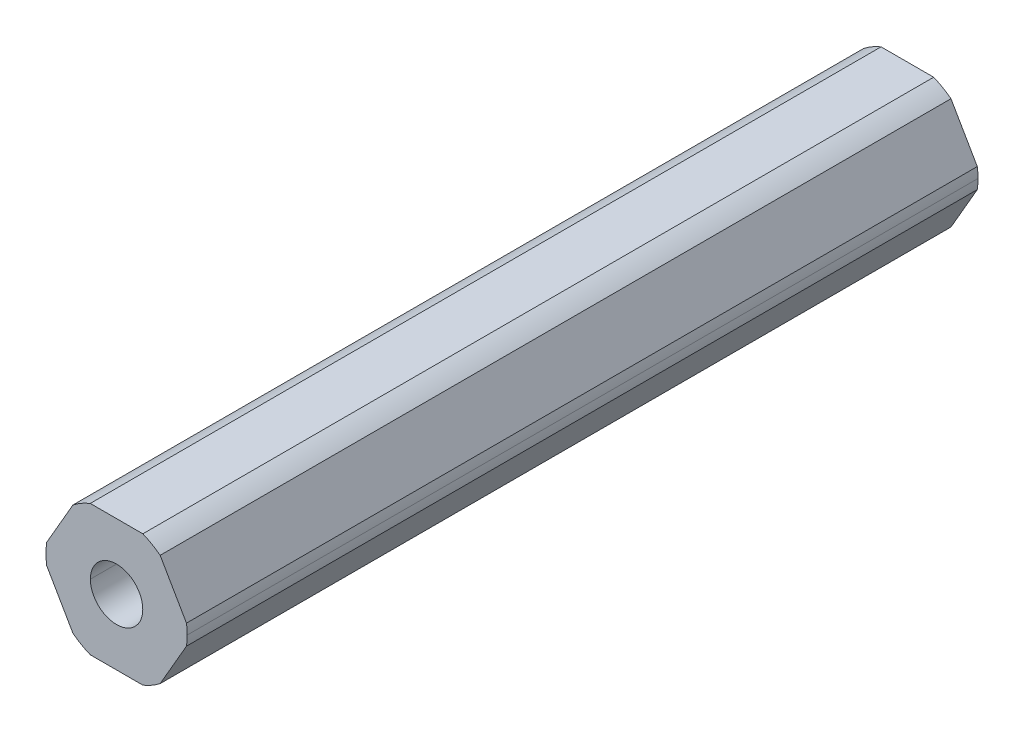
ISO-10303-21;
HEADER;
FILE_DESCRIPTION(('STEP AP214'),'2;1');
FILE_NAME('part.step','',(''),(''),'','','');
FILE_SCHEMA(('AUTOMOTIVE_DESIGN { 1 0 10303 214 1 1 1 1 }'));
ENDSEC;
DATA;
#1=APPLICATION_CONTEXT('core data for automotive mechanical design processes');
#2=APPLICATION_PROTOCOL_DEFINITION('international standard','automotive_design',2000,#1);
#3=PRODUCT_CONTEXT('',#1,'mechanical');
#4=PRODUCT('Part','Part','',(#3));
#5=PRODUCT_RELATED_PRODUCT_CATEGORY('part','',(#4));
#6=PRODUCT_DEFINITION_FORMATION('','',#4);
#7=PRODUCT_DEFINITION_CONTEXT('part definition',#1,'design');
#8=PRODUCT_DEFINITION('design','',#6,#7);
#9=PRODUCT_DEFINITION_SHAPE('','',#8);
#10=(LENGTH_UNIT() NAMED_UNIT(*) SI_UNIT(.MILLI.,.METRE.));
#11=(NAMED_UNIT(*) PLANE_ANGLE_UNIT() SI_UNIT($,.RADIAN.));
#12=(NAMED_UNIT(*) SI_UNIT($,.STERADIAN.) SOLID_ANGLE_UNIT());
#13=UNCERTAINTY_MEASURE_WITH_UNIT(LENGTH_MEASURE(1.E-05),#10,'distance_accuracy_value','');
#14=(GEOMETRIC_REPRESENTATION_CONTEXT(3) GLOBAL_UNCERTAINTY_ASSIGNED_CONTEXT((#13)) GLOBAL_UNIT_ASSIGNED_CONTEXT((#10,
#11,#12)) REPRESENTATION_CONTEXT('',''));
#15=CARTESIAN_POINT('',(0.,0.,0.));
#16=DIRECTION('',(0.,0.,1.));
#17=DIRECTION('',(1.,0.,0.));
#18=AXIS2_PLACEMENT_3D('',#15,#16,#17);
#19=CARTESIAN_POINT('',(0.,0.,-228.6));
#20=DIRECTION('',(0.,0.,1.));
#21=DIRECTION('',(1.,0.,0.));
#22=AXIS2_PLACEMENT_3D('',#19,#20,#21);
#23=CYLINDRICAL_SURFACE('',#22,2.55);
#24=DIRECTION('',(0.,0.,1.));
#25=VECTOR('',#24,1.);
#26=CARTESIAN_POINT('',(2.55,0.,-228.6));
#27=LINE('',#26,#25);
#28=CARTESIAN_POINT('',(2.55,0.,-220.97475));
#29=VERTEX_POINT('',#28);
#30=CARTESIAN_POINT('',(2.55,0.,-144.04975));
#31=VERTEX_POINT('',#30);
#32=EDGE_CURVE('E156',#29,#31,#27,.T.);
#33=ORIENTED_EDGE('',*,*,#32,.F.);
#34=CARTESIAN_POINT('',(0.,0.,-220.97475));
#35=DIRECTION('',(0.,0.,1.));
#36=DIRECTION('',(1.,0.,0.));
#37=AXIS2_PLACEMENT_3D('',#34,#35,#36);
#38=CIRCLE('',#37,2.55);
#39=CARTESIAN_POINT('',(-2.55,0.,-220.97475));
#40=VERTEX_POINT('',#39);
#41=EDGE_CURVE('E67',#29,#40,#38,.F.);
#42=ORIENTED_EDGE('',*,*,#41,.T.);
#43=DIRECTION('',(0.,0.,1.));
#44=VECTOR('',#43,1.);
#45=CARTESIAN_POINT('',(-2.55,0.,-228.6));
#46=LINE('',#45,#44);
#47=CARTESIAN_POINT('',(-2.55,0.,-144.04975));
#48=VERTEX_POINT('',#47);
#49=EDGE_CURVE('E154',#40,#48,#46,.T.);
#50=ORIENTED_EDGE('',*,*,#49,.T.);
#51=CARTESIAN_POINT('',(0.,0.,-144.04975));
#52=DIRECTION('',(0.,0.,1.));
#53=DIRECTION('',(1.,0.,0.));
#54=AXIS2_PLACEMENT_3D('',#51,#52,#53);
#55=CIRCLE('',#54,2.55);
#56=EDGE_CURVE('E203',#31,#48,#55,.F.);
#57=ORIENTED_EDGE('',*,*,#56,.F.);
#58=EDGE_LOOP('',(#33,#42,#50,#57));
#59=FACE_BOUND('',#58,.T.);
#60=ADVANCED_FACE('F44',(#59),#23,.F.);
#61=CARTESIAN_POINT('',(0.,0.,-228.6));
#62=DIRECTION('',(0.,0.,1.));
#63=DIRECTION('',(1.,0.,0.));
#64=AXIS2_PLACEMENT_3D('',#61,#62,#63);
#65=CYLINDRICAL_SURFACE('',#64,6.87);
#66=CARTESIAN_POINT('',(0.,0.,-220.97475));
#67=DIRECTION('',(0.,0.,1.));
#68=DIRECTION('',(1.,0.,0.));
#69=AXIS2_PLACEMENT_3D('',#66,#67,#68);
#70=CIRCLE('',#69,6.87);
#71=CARTESIAN_POINT('',(6.87,0.,-220.97475));
#72=VERTEX_POINT('',#71);
#73=CARTESIAN_POINT('',(6.80102150534208,-0.971085209378955,-220.97475));
#74=VERTEX_POINT('',#73);
#75=EDGE_CURVE('E322',#72,#74,#70,.F.);
#76=ORIENTED_EDGE('',*,*,#75,.F.);
#77=DIRECTION('',(0.,0.,1.));
#78=VECTOR('',#77,1.);
#79=CARTESIAN_POINT('',(6.87,0.,-228.6));
#80=LINE('',#79,#78);
#81=CARTESIAN_POINT('',(6.87,0.,-144.04975));
#82=VERTEX_POINT('',#81);
#83=EDGE_CURVE('E164',#72,#82,#80,.T.);
#84=ORIENTED_EDGE('',*,*,#83,.T.);
#85=CARTESIAN_POINT('',(0.,0.,-144.04975));
#86=DIRECTION('',(0.,0.,1.));
#87=DIRECTION('',(1.,0.,0.));
#88=AXIS2_PLACEMENT_3D('',#85,#86,#87);
#89=CIRCLE('',#88,6.87);
#90=CARTESIAN_POINT('',(6.80102150534208,-0.971085209378955,-144.04975));
#91=VERTEX_POINT('',#90);
#92=EDGE_CURVE('E324',#91,#82,#89,.T.);
#93=ORIENTED_EDGE('',*,*,#92,.F.);
#94=DIRECTION('',(0.,0.,-1.));
#95=VECTOR('',#94,1.);
#96=CARTESIAN_POINT('',(6.80102150534208,-0.971085209378962,-228.6));
#97=LINE('',#96,#95);
#98=EDGE_CURVE('E170',#91,#74,#97,.T.);
#99=ORIENTED_EDGE('',*,*,#98,.T.);
#100=EDGE_LOOP('',(#76,#84,#93,#99));
#101=FACE_BOUND('',#100,.T.);
#102=ADVANCED_FACE('F321',(#101),#65,.T.);
#103=CARTESIAN_POINT('',(3.68083890619154,-6.3754,228.6));
#104=DIRECTION('',(-0.866025403784439,0.5,0.));
#105=DIRECTION('',(0.,0.,1.));
#106=AXIS2_PLACEMENT_3D('',#103,#104,#105);
#107=PLANE('',#106);
#108=DIRECTION('',(0.,0.,1.));
#109=VECTOR('',#108,1.);
#110=CARTESIAN_POINT('',(4.24149521323255,-5.40431479062104,-228.6));
#111=LINE('',#110,#109);
#112=CARTESIAN_POINT('',(4.24149521323254,-5.40431479062105,-220.97475));
#113=VERTEX_POINT('',#112);
#114=CARTESIAN_POINT('',(4.24149521323254,-5.40431479062105,-144.04975));
#115=VERTEX_POINT('',#114);
#116=EDGE_CURVE('E181',#113,#115,#111,.T.);
#117=ORIENTED_EDGE('',*,*,#116,.F.);
#118=DIRECTION('',(0.5,0.866025403784439,0.));
#119=VECTOR('',#118,1.);
#120=CARTESIAN_POINT('',(3.68083890619154,-6.3754,-220.97475));
#121=LINE('',#120,#119);
#122=EDGE_CURVE('E318',#113,#74,#121,.T.);
#123=ORIENTED_EDGE('',*,*,#122,.T.);
#124=ORIENTED_EDGE('',*,*,#98,.F.);
#125=DIRECTION('',(0.500000000000001,0.866025403784438,0.));
#126=VECTOR('',#125,1.);
#127=CARTESIAN_POINT('',(4.24149521323254,-5.40431479062105,-144.04975));
#128=LINE('',#127,#126);
#129=EDGE_CURVE('E265',#115,#91,#128,.T.);
#130=ORIENTED_EDGE('',*,*,#129,.F.);
#131=EDGE_LOOP('',(#117,#123,#124,#130));
#132=FACE_BOUND('',#131,.T.);
#133=ADVANCED_FACE('F316',(#132),#107,.F.);
#134=CARTESIAN_POINT('',(7.36167781238308,0.,228.6));
#135=DIRECTION('',(-0.866025403784439,-0.5,0.));
#136=DIRECTION('',(-0.5,0.866025403784439,0.));
#137=AXIS2_PLACEMENT_3D('',#134,#135,#136);
#138=PLANE('',#137);
#139=DIRECTION('',(0.,0.,1.));
#140=VECTOR('',#139,1.);
#141=CARTESIAN_POINT('',(6.80102150534208,0.971085209378949,-228.6));
#142=LINE('',#141,#140);
#143=CARTESIAN_POINT('',(6.80102150534208,0.97108520937895,-220.97475));
#144=VERTEX_POINT('',#143);
#145=CARTESIAN_POINT('',(6.80102150534208,0.97108520937895,-144.04975));
#146=VERTEX_POINT('',#145);
#147=EDGE_CURVE('E174',#144,#146,#142,.T.);
#148=ORIENTED_EDGE('',*,*,#147,.F.);
#149=DIRECTION('',(-0.5,0.866025403784439,0.));
#150=VECTOR('',#149,1.);
#151=CARTESIAN_POINT('',(7.36167781238308,0.,-220.97475));
#152=LINE('',#151,#150);
#153=CARTESIAN_POINT('',(4.24149521323254,5.40431479062105,-220.97475));
#154=VERTEX_POINT('',#153);
#155=EDGE_CURVE('E351',#144,#154,#152,.T.);
#156=ORIENTED_EDGE('',*,*,#155,.T.);
#157=DIRECTION('',(0.,0.,-1.));
#158=VECTOR('',#157,1.);
#159=CARTESIAN_POINT('',(4.24149521323254,5.40431479062105,-228.6));
#160=LINE('',#159,#158);
#161=CARTESIAN_POINT('',(4.24149521323254,5.40431479062105,-144.04975));
#162=VERTEX_POINT('',#161);
#163=EDGE_CURVE('E204',#162,#154,#160,.T.);
#164=ORIENTED_EDGE('',*,*,#163,.F.);
#165=DIRECTION('',(-0.5,0.866025403784438,0.));
#166=VECTOR('',#165,1.);
#167=CARTESIAN_POINT('',(6.80102150534208,0.97108520937895,-144.04975));
#168=LINE('',#167,#166);
#169=EDGE_CURVE('E232',#146,#162,#168,.T.);
#170=ORIENTED_EDGE('',*,*,#169,.F.);
#171=EDGE_LOOP('',(#148,#156,#164,#170));
#172=FACE_BOUND('',#171,.T.);
#173=ADVANCED_FACE('F360',(#172),#138,.F.);
#174=CARTESIAN_POINT('',(3.68083890619154,6.3754,228.6));
#175=DIRECTION('',(0.,-1.,0.));
#176=DIRECTION('',(0.,0.,-1.));
#177=AXIS2_PLACEMENT_3D('',#174,#175,#176);
#178=PLANE('',#177);
#179=DIRECTION('',(0.,0.,1.));
#180=VECTOR('',#179,1.);
#181=CARTESIAN_POINT('',(2.55952629210952,6.3754,-228.6));
#182=LINE('',#181,#180);
#183=CARTESIAN_POINT('',(2.55952629210952,6.3754,-220.97475));
#184=VERTEX_POINT('',#183);
#185=CARTESIAN_POINT('',(2.55952629210953,6.3754,-144.04975));
#186=VERTEX_POINT('',#185);
#187=EDGE_CURVE('E202',#184,#186,#182,.T.);
#188=ORIENTED_EDGE('',*,*,#187,.F.);
#189=DIRECTION('',(-1.,0.,0.));
#190=VECTOR('',#189,1.);
#191=CARTESIAN_POINT('',(3.68083890619154,6.3754,-220.97475));
#192=LINE('',#191,#190);
#193=CARTESIAN_POINT('',(-2.55952629210953,6.3754,-220.97475));
#194=VERTEX_POINT('',#193);
#195=EDGE_CURVE('E60',#184,#194,#192,.T.);
#196=ORIENTED_EDGE('',*,*,#195,.T.);
#197=DIRECTION('',(0.,0.,-1.));
#198=VECTOR('',#197,1.);
#199=CARTESIAN_POINT('',(-2.55952629210953,6.3754,-228.6));
#200=LINE('',#199,#198);
#201=CARTESIAN_POINT('',(-2.55952629210953,6.3754,-144.04975));
#202=VERTEX_POINT('',#201);
#203=EDGE_CURVE('E193',#202,#194,#200,.T.);
#204=ORIENTED_EDGE('',*,*,#203,.F.);
#205=DIRECTION('',(-1.,0.,0.));
#206=VECTOR('',#205,1.);
#207=CARTESIAN_POINT('',(2.55952629210953,6.3754,-144.04975));
#208=LINE('',#207,#206);
#209=EDGE_CURVE('E228',#186,#202,#208,.T.);
#210=ORIENTED_EDGE('',*,*,#209,.F.);
#211=EDGE_LOOP('',(#188,#196,#204,#210));
#212=FACE_BOUND('',#211,.T.);
#213=ADVANCED_FACE('F46',(#212),#178,.F.);
#214=CARTESIAN_POINT('',(-3.68083890619154,6.3754,228.6));
#215=DIRECTION('',(0.866025403784439,-0.5,0.));
#216=DIRECTION('',(0.,0.,-1.));
#217=AXIS2_PLACEMENT_3D('',#214,#215,#216);
#218=PLANE('',#217);
#219=DIRECTION('',(0.,0.,1.));
#220=VECTOR('',#219,1.);
#221=CARTESIAN_POINT('',(-4.24149521323255,5.40431479062105,-228.6));
#222=LINE('',#221,#220);
#223=CARTESIAN_POINT('',(-4.24149521323255,5.40431479062105,-220.97475));
#224=VERTEX_POINT('',#223);
#225=CARTESIAN_POINT('',(-4.24149521323254,5.40431479062105,-144.04975));
#226=VERTEX_POINT('',#225);
#227=EDGE_CURVE('E208',#224,#226,#222,.T.);
#228=ORIENTED_EDGE('',*,*,#227,.F.);
#229=DIRECTION('',(-0.5,-0.866025403784439,0.));
#230=VECTOR('',#229,1.);
#231=CARTESIAN_POINT('',(-3.68083890619154,6.3754,-220.97475));
#232=LINE('',#231,#230);
#233=CARTESIAN_POINT('',(-6.80102150534207,0.97108520937896,-220.97475));
#234=VERTEX_POINT('',#233);
#235=EDGE_CURVE('E282',#224,#234,#232,.T.);
#236=ORIENTED_EDGE('',*,*,#235,.T.);
#237=DIRECTION('',(0.,0.,-1.));
#238=VECTOR('',#237,1.);
#239=CARTESIAN_POINT('',(-6.80102150534208,0.97108520937896,-228.6));
#240=LINE('',#239,#238);
#241=CARTESIAN_POINT('',(-6.80102150534208,0.97108520937896,-144.04975));
#242=VERTEX_POINT('',#241);
#243=EDGE_CURVE('E176',#242,#234,#240,.T.);
#244=ORIENTED_EDGE('',*,*,#243,.F.);
#245=DIRECTION('',(-0.5,-0.866025403784438,0.));
#246=VECTOR('',#245,1.);
#247=CARTESIAN_POINT('',(-4.24149521323255,5.40431479062105,-144.04975));
#248=LINE('',#247,#246);
#249=EDGE_CURVE('E241',#226,#242,#248,.T.);
#250=ORIENTED_EDGE('',*,*,#249,.F.);
#251=EDGE_LOOP('',(#228,#236,#244,#250));
#252=FACE_BOUND('',#251,.T.);
#253=ADVANCED_FACE('F281',(#252),#218,.F.);
#254=CARTESIAN_POINT('',(-7.36167781238308,0.,228.6));
#255=DIRECTION('',(0.866025403784439,0.5,0.));
#256=DIRECTION('',(0.,0.,-1.));
#257=AXIS2_PLACEMENT_3D('',#254,#255,#256);
#258=PLANE('',#257);
#259=DIRECTION('',(0.,0.,1.));
#260=VECTOR('',#259,1.);
#261=CARTESIAN_POINT('',(-6.80102150534208,-0.971085209378962,-228.6));
#262=LINE('',#261,#260);
#263=CARTESIAN_POINT('',(-6.80102150534208,-0.971085209378953,-220.97475));
#264=VERTEX_POINT('',#263);
#265=CARTESIAN_POINT('',(-6.80102150534208,-0.971085209378951,-144.04975));
#266=VERTEX_POINT('',#265);
#267=EDGE_CURVE('E180',#264,#266,#262,.T.);
#268=ORIENTED_EDGE('',*,*,#267,.F.);
#269=DIRECTION('',(0.5,-0.866025403784439,0.));
#270=VECTOR('',#269,1.);
#271=CARTESIAN_POINT('',(-7.36167781238308,0.,-220.97475));
#272=LINE('',#271,#270);
#273=CARTESIAN_POINT('',(-4.24149521323254,-5.40431479062105,-220.97475));
#274=VERTEX_POINT('',#273);
#275=EDGE_CURVE('E294',#264,#274,#272,.T.);
#276=ORIENTED_EDGE('',*,*,#275,.T.);
#277=DIRECTION('',(0.,0.,-1.));
#278=VECTOR('',#277,1.);
#279=CARTESIAN_POINT('',(-4.24149521323255,-5.40431479062104,-228.6));
#280=LINE('',#279,#278);
#281=CARTESIAN_POINT('',(-4.24149521323254,-5.40431479062105,-144.04975));
#282=VERTEX_POINT('',#281);
#283=EDGE_CURVE('E187',#282,#274,#280,.T.);
#284=ORIENTED_EDGE('',*,*,#283,.F.);
#285=DIRECTION('',(0.5,-0.866025403784439,0.));
#286=VECTOR('',#285,1.);
#287=CARTESIAN_POINT('',(-6.80102150534208,-0.971085209378954,-144.04975));
#288=LINE('',#287,#286);
#289=EDGE_CURVE('E251',#266,#282,#288,.T.);
#290=ORIENTED_EDGE('',*,*,#289,.F.);
#291=EDGE_LOOP('',(#268,#276,#284,#290));
#292=FACE_BOUND('',#291,.T.);
#293=ADVANCED_FACE('F292',(#292),#258,.F.);
#294=CARTESIAN_POINT('',(-3.68083890619154,-6.3754,228.6));
#295=DIRECTION('',(0.,1.,0.));
#296=DIRECTION('',(1.,0.,0.));
#297=AXIS2_PLACEMENT_3D('',#294,#295,#296);
#298=PLANE('',#297);
#299=DIRECTION('',(0.,0.,1.));
#300=VECTOR('',#299,1.);
#301=CARTESIAN_POINT('',(-2.55952629210953,-6.3754,-228.6));
#302=LINE('',#301,#300);
#303=CARTESIAN_POINT('',(-2.55952629210953,-6.3754,-220.97475));
#304=VERTEX_POINT('',#303);
#305=CARTESIAN_POINT('',(-2.55952629210953,-6.3754,-144.04975));
#306=VERTEX_POINT('',#305);
#307=EDGE_CURVE('E179',#304,#306,#302,.T.);
#308=ORIENTED_EDGE('',*,*,#307,.F.);
#309=DIRECTION('',(1.,0.,0.));
#310=VECTOR('',#309,1.);
#311=CARTESIAN_POINT('',(-3.68083890619154,-6.3754,-220.97475));
#312=LINE('',#311,#310);
#313=CARTESIAN_POINT('',(2.55952629210953,-6.3754,-220.97475));
#314=VERTEX_POINT('',#313);
#315=EDGE_CURVE('E306',#304,#314,#312,.T.);
#316=ORIENTED_EDGE('',*,*,#315,.T.);
#317=DIRECTION('',(0.,0.,-1.));
#318=VECTOR('',#317,1.);
#319=CARTESIAN_POINT('',(2.55952629210953,-6.3754,-228.6));
#320=LINE('',#319,#318);
#321=CARTESIAN_POINT('',(2.55952629210953,-6.3754,-144.04975));
#322=VERTEX_POINT('',#321);
#323=EDGE_CURVE('E184',#322,#314,#320,.T.);
#324=ORIENTED_EDGE('',*,*,#323,.F.);
#325=DIRECTION('',(1.,0.,0.));
#326=VECTOR('',#325,1.);
#327=CARTESIAN_POINT('',(-2.55952629210953,-6.3754,-144.04975));
#328=LINE('',#327,#326);
#329=EDGE_CURVE('E258',#306,#322,#328,.T.);
#330=ORIENTED_EDGE('',*,*,#329,.F.);
#331=EDGE_LOOP('',(#308,#316,#324,#330));
#332=FACE_BOUND('',#331,.T.);
#333=ADVANCED_FACE('F304',(#332),#298,.F.);
#334=CARTESIAN_POINT('',(0.,0.,-228.6));
#335=DIRECTION('',(0.,0.,1.));
#336=DIRECTION('',(1.,0.,0.));
#337=AXIS2_PLACEMENT_3D('',#334,#335,#336);
#338=CYLINDRICAL_SURFACE('',#337,6.87);
#339=CARTESIAN_POINT('',(0.,0.,-220.97475));
#340=DIRECTION('',(0.,0.,1.));
#341=DIRECTION('',(1.,0.,0.));
#342=AXIS2_PLACEMENT_3D('',#339,#340,#341);
#343=CIRCLE('',#342,6.87);
#344=EDGE_CURVE('E347',#144,#72,#343,.F.);
#345=ORIENTED_EDGE('',*,*,#344,.F.);
#346=ORIENTED_EDGE('',*,*,#147,.T.);
#347=EDGE_CURVE('E327',#82,#146,#89,.T.);
#348=ORIENTED_EDGE('',*,*,#347,.F.);
#349=ORIENTED_EDGE('',*,*,#83,.F.);
#350=EDGE_LOOP('',(#345,#346,#348,#349));
#351=FACE_BOUND('',#350,.T.);
#352=ADVANCED_FACE('F362',(#351),#338,.T.);
#353=CARTESIAN_POINT('',(0.,0.,-228.6));
#354=DIRECTION('',(0.,0.,1.));
#355=DIRECTION('',(1.,0.,0.));
#356=AXIS2_PLACEMENT_3D('',#353,#354,#355);
#357=CYLINDRICAL_SURFACE('',#356,6.87);
#358=CARTESIAN_POINT('',(0.,0.,-220.97475));
#359=DIRECTION('',(0.,0.,1.));
#360=DIRECTION('',(1.,0.,0.));
#361=AXIS2_PLACEMENT_3D('',#358,#359,#360);
#362=CIRCLE('',#361,6.87);
#363=EDGE_CURVE('E310',#113,#314,#362,.F.);
#364=ORIENTED_EDGE('',*,*,#363,.F.);
#365=ORIENTED_EDGE('',*,*,#116,.T.);
#366=CARTESIAN_POINT('',(0.,0.,-144.04975));
#367=DIRECTION('',(0.,0.,1.));
#368=DIRECTION('',(1.,0.,0.));
#369=AXIS2_PLACEMENT_3D('',#366,#367,#368);
#370=CIRCLE('',#369,6.87);
#371=EDGE_CURVE('E261',#322,#115,#370,.T.);
#372=ORIENTED_EDGE('',*,*,#371,.F.);
#373=ORIENTED_EDGE('',*,*,#323,.T.);
#374=EDGE_LOOP('',(#364,#365,#372,#373));
#375=FACE_BOUND('',#374,.T.);
#376=ADVANCED_FACE('F309',(#375),#357,.T.);
#377=CARTESIAN_POINT('',(0.,0.,-228.6));
#378=DIRECTION('',(0.,0.,1.));
#379=DIRECTION('',(1.,0.,0.));
#380=AXIS2_PLACEMENT_3D('',#377,#378,#379);
#381=CYLINDRICAL_SURFACE('',#380,6.87);
#382=CARTESIAN_POINT('',(0.,0.,-220.97475));
#383=DIRECTION('',(0.,0.,1.));
#384=DIRECTION('',(1.,0.,0.));
#385=AXIS2_PLACEMENT_3D('',#382,#383,#384);
#386=CIRCLE('',#385,6.87);
#387=EDGE_CURVE('E298',#304,#274,#386,.F.);
#388=ORIENTED_EDGE('',*,*,#387,.F.);
#389=ORIENTED_EDGE('',*,*,#307,.T.);
#390=CARTESIAN_POINT('',(0.,0.,-144.04975));
#391=DIRECTION('',(0.,0.,1.));
#392=DIRECTION('',(1.,0.,0.));
#393=AXIS2_PLACEMENT_3D('',#390,#391,#392);
#394=CIRCLE('',#393,6.87);
#395=EDGE_CURVE('E254',#282,#306,#394,.T.);
#396=ORIENTED_EDGE('',*,*,#395,.F.);
#397=ORIENTED_EDGE('',*,*,#283,.T.);
#398=EDGE_LOOP('',(#388,#389,#396,#397));
#399=FACE_BOUND('',#398,.T.);
#400=ADVANCED_FACE('F297',(#399),#381,.T.);
#401=CARTESIAN_POINT('',(0.,0.,-228.6));
#402=DIRECTION('',(0.,0.,1.));
#403=DIRECTION('',(1.,0.,0.));
#404=AXIS2_PLACEMENT_3D('',#401,#402,#403);
#405=CYLINDRICAL_SURFACE('',#404,6.87);
#406=CARTESIAN_POINT('',(0.,0.,-220.97475));
#407=DIRECTION('',(0.,0.,1.));
#408=DIRECTION('',(1.,0.,0.));
#409=AXIS2_PLACEMENT_3D('',#406,#407,#408);
#410=CIRCLE('',#409,6.87);
#411=EDGE_CURVE('E286',#264,#234,#410,.F.);
#412=ORIENTED_EDGE('',*,*,#411,.F.);
#413=ORIENTED_EDGE('',*,*,#267,.T.);
#414=CARTESIAN_POINT('',(0.,0.,-144.04975));
#415=DIRECTION('',(0.,0.,1.));
#416=DIRECTION('',(1.,0.,0.));
#417=AXIS2_PLACEMENT_3D('',#414,#415,#416);
#418=CIRCLE('',#417,6.87);
#419=EDGE_CURVE('E247',#242,#266,#418,.T.);
#420=ORIENTED_EDGE('',*,*,#419,.F.);
#421=ORIENTED_EDGE('',*,*,#243,.T.);
#422=EDGE_LOOP('',(#412,#413,#420,#421));
#423=FACE_BOUND('',#422,.T.);
#424=ADVANCED_FACE('F285',(#423),#405,.T.);
#425=CARTESIAN_POINT('',(0.,0.,-228.6));
#426=DIRECTION('',(0.,0.,1.));
#427=DIRECTION('',(1.,0.,0.));
#428=AXIS2_PLACEMENT_3D('',#425,#426,#427);
#429=CYLINDRICAL_SURFACE('',#428,6.87);
#430=CARTESIAN_POINT('',(0.,0.,-220.97475));
#431=DIRECTION('',(0.,0.,1.));
#432=DIRECTION('',(1.,0.,0.));
#433=AXIS2_PLACEMENT_3D('',#430,#431,#432);
#434=CIRCLE('',#433,6.87);
#435=EDGE_CURVE('E275',#224,#194,#434,.F.);
#436=ORIENTED_EDGE('',*,*,#435,.F.);
#437=ORIENTED_EDGE('',*,*,#227,.T.);
#438=CARTESIAN_POINT('',(0.,0.,-144.04975));
#439=DIRECTION('',(0.,0.,1.));
#440=DIRECTION('',(1.,0.,0.));
#441=AXIS2_PLACEMENT_3D('',#438,#439,#440);
#442=CIRCLE('',#441,6.87);
#443=EDGE_CURVE('E237',#202,#226,#442,.T.);
#444=ORIENTED_EDGE('',*,*,#443,.F.);
#445=ORIENTED_EDGE('',*,*,#203,.T.);
#446=EDGE_LOOP('',(#436,#437,#444,#445));
#447=FACE_BOUND('',#446,.T.);
#448=ADVANCED_FACE('F274',(#447),#429,.T.);
#449=CARTESIAN_POINT('',(0.,0.,-228.6));
#450=DIRECTION('',(0.,0.,1.));
#451=DIRECTION('',(1.,0.,0.));
#452=AXIS2_PLACEMENT_3D('',#449,#450,#451);
#453=CYLINDRICAL_SURFACE('',#452,6.87);
#454=CARTESIAN_POINT('',(0.,0.,-220.97475));
#455=DIRECTION('',(0.,0.,1.));
#456=DIRECTION('',(1.,0.,0.));
#457=AXIS2_PLACEMENT_3D('',#454,#455,#456);
#458=CIRCLE('',#457,6.87);
#459=EDGE_CURVE('E158',#184,#154,#458,.F.);
#460=ORIENTED_EDGE('',*,*,#459,.F.);
#461=ORIENTED_EDGE('',*,*,#187,.T.);
#462=CARTESIAN_POINT('',(0.,0.,-144.04975));
#463=DIRECTION('',(0.,0.,1.));
#464=DIRECTION('',(1.,0.,0.));
#465=AXIS2_PLACEMENT_3D('',#462,#463,#464);
#466=CIRCLE('',#465,6.87);
#467=EDGE_CURVE('E219',#162,#186,#466,.T.);
#468=ORIENTED_EDGE('',*,*,#467,.F.);
#469=ORIENTED_EDGE('',*,*,#163,.T.);
#470=EDGE_LOOP('',(#460,#461,#468,#469));
#471=FACE_BOUND('',#470,.T.);
#472=ADVANCED_FACE('F218',(#471),#453,.T.);
#473=CARTESIAN_POINT('',(0.,0.,-228.6));
#474=DIRECTION('',(0.,0.,1.));
#475=DIRECTION('',(1.,0.,0.));
#476=AXIS2_PLACEMENT_3D('',#473,#474,#475);
#477=CYLINDRICAL_SURFACE('',#476,2.55);
#478=ORIENTED_EDGE('',*,*,#49,.F.);
#479=CARTESIAN_POINT('',(0.,0.,-220.97475));
#480=DIRECTION('',(0.,0.,1.));
#481=DIRECTION('',(1.,0.,0.));
#482=AXIS2_PLACEMENT_3D('',#479,#480,#481);
#483=CIRCLE('',#482,2.55);
#484=EDGE_CURVE('E11',#40,#29,#483,.F.);
#485=ORIENTED_EDGE('',*,*,#484,.T.);
#486=ORIENTED_EDGE('',*,*,#32,.T.);
#487=CARTESIAN_POINT('',(0.,0.,-144.04975));
#488=DIRECTION('',(0.,0.,1.));
#489=DIRECTION('',(1.,0.,0.));
#490=AXIS2_PLACEMENT_3D('',#487,#488,#489);
#491=CIRCLE('',#490,2.55);
#492=EDGE_CURVE('E53',#48,#31,#491,.F.);
#493=ORIENTED_EDGE('',*,*,#492,.F.);
#494=EDGE_LOOP('',(#478,#485,#486,#493));
#495=FACE_BOUND('',#494,.T.);
#496=ADVANCED_FACE('F161',(#495),#477,.F.);
#497=CARTESIAN_POINT('',(0.,0.,-144.04975));
#498=DIRECTION('',(0.,0.,1.));
#499=DIRECTION('',(1.,0.,0.));
#500=AXIS2_PLACEMENT_3D('',#497,#498,#499);
#501=PLANE('',#500);
#502=ORIENTED_EDGE('',*,*,#92,.T.);
#503=ORIENTED_EDGE('',*,*,#347,.T.);
#504=ORIENTED_EDGE('',*,*,#169,.T.);
#505=ORIENTED_EDGE('',*,*,#467,.T.);
#506=ORIENTED_EDGE('',*,*,#209,.T.);
#507=ORIENTED_EDGE('',*,*,#443,.T.);
#508=ORIENTED_EDGE('',*,*,#249,.T.);
#509=ORIENTED_EDGE('',*,*,#419,.T.);
#510=ORIENTED_EDGE('',*,*,#289,.T.);
#511=ORIENTED_EDGE('',*,*,#395,.T.);
#512=ORIENTED_EDGE('',*,*,#329,.T.);
#513=ORIENTED_EDGE('',*,*,#371,.T.);
#514=ORIENTED_EDGE('',*,*,#129,.T.);
#515=EDGE_LOOP('',(#502,#503,#504,#505,#506,#507,#508,#509,#510,#511,#512,#513,#514));
#516=FACE_BOUND('',#515,.T.);
#517=ORIENTED_EDGE('',*,*,#56,.T.);
#518=ORIENTED_EDGE('',*,*,#492,.T.);
#519=EDGE_LOOP('',(#517,#518));
#520=FACE_BOUND('',#519,.T.);
#521=ADVANCED_FACE('F225',(#516,#520),#501,.T.);
#522=CARTESIAN_POINT('',(0.,0.,-220.97475));
#523=DIRECTION('',(0.,0.,1.));
#524=DIRECTION('',(-0.5,0.866025403784439,0.));
#525=AXIS2_PLACEMENT_3D('',#522,#523,#524);
#526=PLANE('',#525);
#527=ORIENTED_EDGE('',*,*,#484,.F.);
#528=ORIENTED_EDGE('',*,*,#41,.F.);
#529=EDGE_LOOP('',(#527,#528));
#530=FACE_BOUND('',#529,.T.);
#531=ORIENTED_EDGE('',*,*,#387,.T.);
#532=ORIENTED_EDGE('',*,*,#275,.F.);
#533=ORIENTED_EDGE('',*,*,#411,.T.);
#534=ORIENTED_EDGE('',*,*,#235,.F.);
#535=ORIENTED_EDGE('',*,*,#435,.T.);
#536=ORIENTED_EDGE('',*,*,#195,.F.);
#537=ORIENTED_EDGE('',*,*,#459,.T.);
#538=ORIENTED_EDGE('',*,*,#155,.F.);
#539=ORIENTED_EDGE('',*,*,#344,.T.);
#540=ORIENTED_EDGE('',*,*,#75,.T.);
#541=ORIENTED_EDGE('',*,*,#122,.F.);
#542=ORIENTED_EDGE('',*,*,#363,.T.);
#543=ORIENTED_EDGE('',*,*,#315,.F.);
#544=EDGE_LOOP('',(#531,#532,#533,#534,#535,#536,#537,#538,#539,#540,#541,#542,#543));
#545=FACE_BOUND('',#544,.T.);
#546=ADVANCED_FACE('F148',(#530,#545),#526,.F.);
#547=CLOSED_SHELL('',(#60,#102,#133,#173,#213,#253,#293,#333,#352,#376,#400,#424,#448,#472,#496,
#521,#546));
#548=MANIFOLD_SOLID_BREP('B2',#547);
#549=ADVANCED_BREP_SHAPE_REPRESENTATION('',(#18,#548),#14);
#550=SHAPE_DEFINITION_REPRESENTATION(#9,#549);
ENDSEC;
END-ISO-10303-21;
